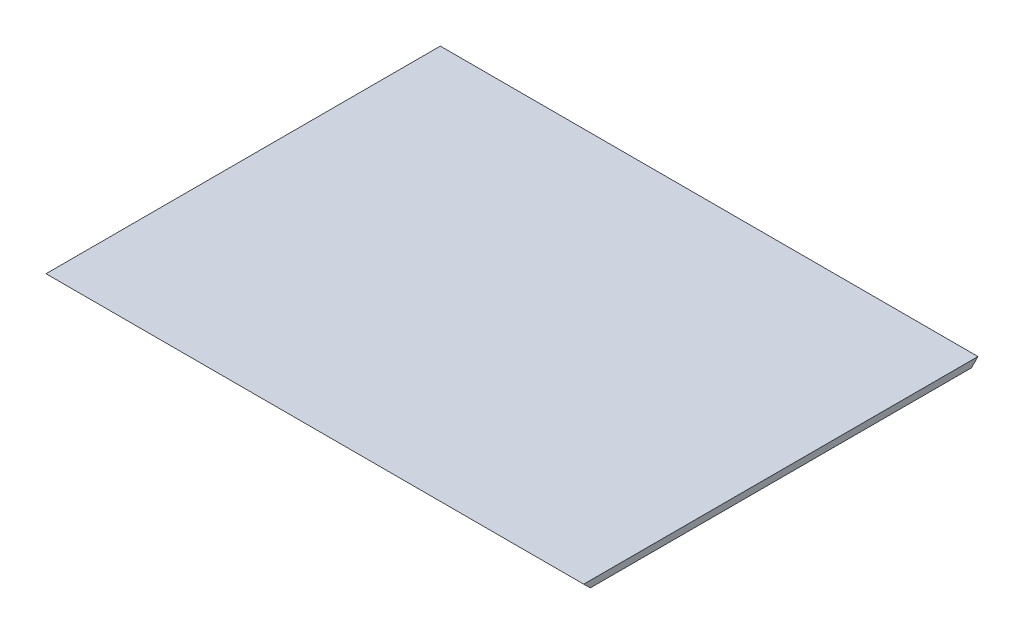
ISO-10303-21;
HEADER;
FILE_DESCRIPTION(('STEP AP214'),'2;1');
FILE_NAME('part.step','',(''),(''),'','','');
FILE_SCHEMA(('AUTOMOTIVE_DESIGN { 1 0 10303 214 1 1 1 1 }'));
ENDSEC;
DATA;
#1=APPLICATION_CONTEXT('core data for automotive mechanical design processes');
#2=APPLICATION_PROTOCOL_DEFINITION('international standard','automotive_design',2000,#1);
#3=PRODUCT_CONTEXT('',#1,'mechanical');
#4=PRODUCT('Part','Part','',(#3));
#5=PRODUCT_RELATED_PRODUCT_CATEGORY('part','',(#4));
#6=PRODUCT_DEFINITION_FORMATION('','',#4);
#7=PRODUCT_DEFINITION_CONTEXT('part definition',#1,'design');
#8=PRODUCT_DEFINITION('design','',#6,#7);
#9=PRODUCT_DEFINITION_SHAPE('','',#8);
#10=(LENGTH_UNIT() NAMED_UNIT(*) SI_UNIT(.MILLI.,.METRE.));
#11=(NAMED_UNIT(*) PLANE_ANGLE_UNIT() SI_UNIT($,.RADIAN.));
#12=(NAMED_UNIT(*) SI_UNIT($,.STERADIAN.) SOLID_ANGLE_UNIT());
#13=UNCERTAINTY_MEASURE_WITH_UNIT(LENGTH_MEASURE(1.E-05),#10,'distance_accuracy_value','');
#14=(GEOMETRIC_REPRESENTATION_CONTEXT(3) GLOBAL_UNCERTAINTY_ASSIGNED_CONTEXT((#13)) GLOBAL_UNIT_ASSIGNED_CONTEXT((#10,
#11,#12)) REPRESENTATION_CONTEXT('',''));
#15=CARTESIAN_POINT('',(0.,0.,0.));
#16=DIRECTION('',(0.,0.,1.));
#17=DIRECTION('',(1.,0.,0.));
#18=AXIS2_PLACEMENT_3D('',#15,#16,#17);
#19=CARTESIAN_POINT('',(130.175,1.5875,120.523));
#20=DIRECTION('',(-1.,0.,0.));
#21=DIRECTION('',(0.,0.,1.));
#22=AXIS2_PLACEMENT_3D('',#19,#20,#21);
#23=PLANE('',#22);
#24=DIRECTION('',(0.,0.,-1.));
#25=VECTOR('',#24,1.);
#26=CARTESIAN_POINT('',(130.175,-1.5875,120.523));
#27=LINE('',#26,#25);
#28=CARTESIAN_POINT('',(130.175,-1.58749999999999,117.316753604113));
#29=VERTEX_POINT('',#28);
#30=CARTESIAN_POINT('',(130.175,-1.5875,-67.2222451339304));
#31=VERTEX_POINT('',#30);
#32=EDGE_CURVE('E87',#29,#31,#27,.T.);
#33=ORIENTED_EDGE('',*,*,#32,.T.);
#34=DIRECTION('',(0.,0.707106781186539,-0.707106781186556));
#35=VECTOR('',#34,1.);
#36=CARTESIAN_POINT('',(130.175,27.0190661540212,-95.8288112879522));
#37=LINE('',#36,#35);
#38=CARTESIAN_POINT('',(130.175,1.58749999999999,-70.3972451339304));
#39=VERTEX_POINT('',#38);
#40=EDGE_CURVE('E47',#31,#39,#37,.T.);
#41=ORIENTED_EDGE('',*,*,#40,.T.);
#42=DIRECTION('',(0.,0.,-1.));
#43=VECTOR('',#42,1.);
#44=CARTESIAN_POINT('',(130.175,1.5875,120.523));
#45=LINE('',#44,#43);
#46=CARTESIAN_POINT('',(130.175,1.58749999999999,120.523));
#47=VERTEX_POINT('',#46);
#48=EDGE_CURVE('E89',#47,#39,#45,.T.);
#49=ORIENTED_EDGE('',*,*,#48,.F.);
#50=DIRECTION('',(0.,-0.703635928435692,-0.710560680177592));
#51=VECTOR('',#50,1.);
#52=CARTESIAN_POINT('',(130.175,1.58749999999999,120.523));
#53=LINE('',#52,#51);
#54=EDGE_CURVE('E97',#47,#29,#53,.T.);
#55=ORIENTED_EDGE('',*,*,#54,.T.);
#56=EDGE_LOOP('',(#33,#41,#49,#55));
#57=FACE_BOUND('',#56,.T.);
#58=ADVANCED_FACE('F33',(#57),#23,.F.);
#59=CARTESIAN_POINT('',(-130.175,1.5875,120.523));
#60=DIRECTION('',(-1.,0.,0.));
#61=DIRECTION('',(0.,0.,1.));
#62=AXIS2_PLACEMENT_3D('',#59,#60,#61);
#63=PLANE('',#62);
#64=DIRECTION('',(0.,0.707106781186539,-0.707106781186556));
#65=VECTOR('',#64,1.);
#66=CARTESIAN_POINT('',(-130.175,27.0190661540212,-95.8288112879522));
#67=LINE('',#66,#65);
#68=CARTESIAN_POINT('',(-130.175,-1.5875,-67.2222451339304));
#69=VERTEX_POINT('',#68);
#70=CARTESIAN_POINT('',(-130.175,1.58749999999999,-70.3972451339304));
#71=VERTEX_POINT('',#70);
#72=EDGE_CURVE('E71',#69,#71,#67,.T.);
#73=ORIENTED_EDGE('',*,*,#72,.F.);
#74=DIRECTION('',(0.,0.,-1.));
#75=VECTOR('',#74,1.);
#76=CARTESIAN_POINT('',(-130.175,-1.5875,120.523));
#77=LINE('',#76,#75);
#78=CARTESIAN_POINT('',(-130.175,-1.5875,117.316753604113));
#79=VERTEX_POINT('',#78);
#80=EDGE_CURVE('E81',#79,#69,#77,.T.);
#81=ORIENTED_EDGE('',*,*,#80,.F.);
#82=DIRECTION('',(0.,-0.703635928435692,-0.710560680177592));
#83=VECTOR('',#82,1.);
#84=CARTESIAN_POINT('',(-130.175,1.58749999999999,120.523));
#85=LINE('',#84,#83);
#86=CARTESIAN_POINT('',(-130.175,1.58749999999999,120.523));
#87=VERTEX_POINT('',#86);
#88=EDGE_CURVE('E54',#87,#79,#85,.T.);
#89=ORIENTED_EDGE('',*,*,#88,.F.);
#90=DIRECTION('',(0.,0.,-1.));
#91=VECTOR('',#90,1.);
#92=CARTESIAN_POINT('',(-130.175,1.5875,120.523));
#93=LINE('',#92,#91);
#94=EDGE_CURVE('E40',#87,#71,#93,.T.);
#95=ORIENTED_EDGE('',*,*,#94,.T.);
#96=EDGE_LOOP('',(#73,#81,#89,#95));
#97=FACE_BOUND('',#96,.T.);
#98=ADVANCED_FACE('F80',(#97),#63,.T.);
#99=CARTESIAN_POINT('',(0.,1.5875,0.));
#100=DIRECTION('',(0.,1.,0.));
#101=DIRECTION('',(0.,0.,1.));
#102=AXIS2_PLACEMENT_3D('',#99,#100,#101);
#103=PLANE('',#102);
#104=DIRECTION('',(1.,0.,0.));
#105=VECTOR('',#104,1.);
#106=CARTESIAN_POINT('',(0.,1.5875,-70.3972451339304));
#107=LINE('',#106,#105);
#108=EDGE_CURVE('E99',#71,#39,#107,.T.);
#109=ORIENTED_EDGE('',*,*,#108,.F.);
#110=ORIENTED_EDGE('',*,*,#94,.F.);
#111=DIRECTION('',(1.,0.,0.));
#112=VECTOR('',#111,1.);
#113=CARTESIAN_POINT('',(-130.175,1.5875,120.523));
#114=LINE('',#113,#112);
#115=EDGE_CURVE('E86',#87,#47,#114,.T.);
#116=ORIENTED_EDGE('',*,*,#115,.T.);
#117=ORIENTED_EDGE('',*,*,#48,.T.);
#118=EDGE_LOOP('',(#109,#110,#116,#117));
#119=FACE_BOUND('',#118,.T.);
#120=ADVANCED_FACE('F106',(#119),#103,.T.);
#121=CARTESIAN_POINT('',(0.,-1.5875,0.));
#122=DIRECTION('',(0.,1.,0.));
#123=DIRECTION('',(0.,0.,1.));
#124=AXIS2_PLACEMENT_3D('',#121,#122,#123);
#125=PLANE('',#124);
#126=ORIENTED_EDGE('',*,*,#80,.T.);
#127=DIRECTION('',(1.,0.,0.));
#128=VECTOR('',#127,1.);
#129=CARTESIAN_POINT('',(0.,-1.5875,-67.2222451339303));
#130=LINE('',#129,#128);
#131=EDGE_CURVE('E11',#69,#31,#130,.T.);
#132=ORIENTED_EDGE('',*,*,#131,.T.);
#133=ORIENTED_EDGE('',*,*,#32,.F.);
#134=DIRECTION('',(-1.,0.,0.));
#135=VECTOR('',#134,1.);
#136=CARTESIAN_POINT('',(130.175,-1.58749999999999,117.316753604113));
#137=LINE('',#136,#135);
#138=EDGE_CURVE('E85',#29,#79,#137,.T.);
#139=ORIENTED_EDGE('',*,*,#138,.T.);
#140=EDGE_LOOP('',(#126,#132,#133,#139));
#141=FACE_BOUND('',#140,.T.);
#142=ADVANCED_FACE('F84',(#141),#125,.F.);
#143=CARTESIAN_POINT('',(130.175,1.58749999999999,120.523));
#144=DIRECTION('',(0.,0.710560680177592,-0.703635928435692));
#145=DIRECTION('',(0.,0.703635928435692,0.710560680177592));
#146=AXIS2_PLACEMENT_3D('',#143,#144,#145);
#147=PLANE('',#146);
#148=ORIENTED_EDGE('',*,*,#88,.T.);
#149=ORIENTED_EDGE('',*,*,#138,.F.);
#150=ORIENTED_EDGE('',*,*,#54,.F.);
#151=ORIENTED_EDGE('',*,*,#115,.F.);
#152=EDGE_LOOP('',(#148,#149,#150,#151));
#153=FACE_BOUND('',#152,.T.);
#154=ADVANCED_FACE('F107',(#153),#147,.F.);
#155=CARTESIAN_POINT('',(130.175,27.0190661540212,-95.8288112879522));
#156=DIRECTION('',(0.,0.707106781186556,0.707106781186539));
#157=DIRECTION('',(0.,-0.707106781186539,0.707106781186556));
#158=AXIS2_PLACEMENT_3D('',#155,#156,#157);
#159=PLANE('',#158);
#160=ORIENTED_EDGE('',*,*,#108,.T.);
#161=ORIENTED_EDGE('',*,*,#40,.F.);
#162=ORIENTED_EDGE('',*,*,#131,.F.);
#163=ORIENTED_EDGE('',*,*,#72,.T.);
#164=EDGE_LOOP('',(#160,#161,#162,#163));
#165=FACE_BOUND('',#164,.T.);
#166=ADVANCED_FACE('F70',(#165),#159,.F.);
#167=CLOSED_SHELL('',(#58,#98,#120,#142,#154,#166));
#168=MANIFOLD_SOLID_BREP('B2',#167);
#169=ADVANCED_BREP_SHAPE_REPRESENTATION('',(#18,#168),#14);
#170=SHAPE_DEFINITION_REPRESENTATION(#9,#169);
ENDSEC;
END-ISO-10303-21;
